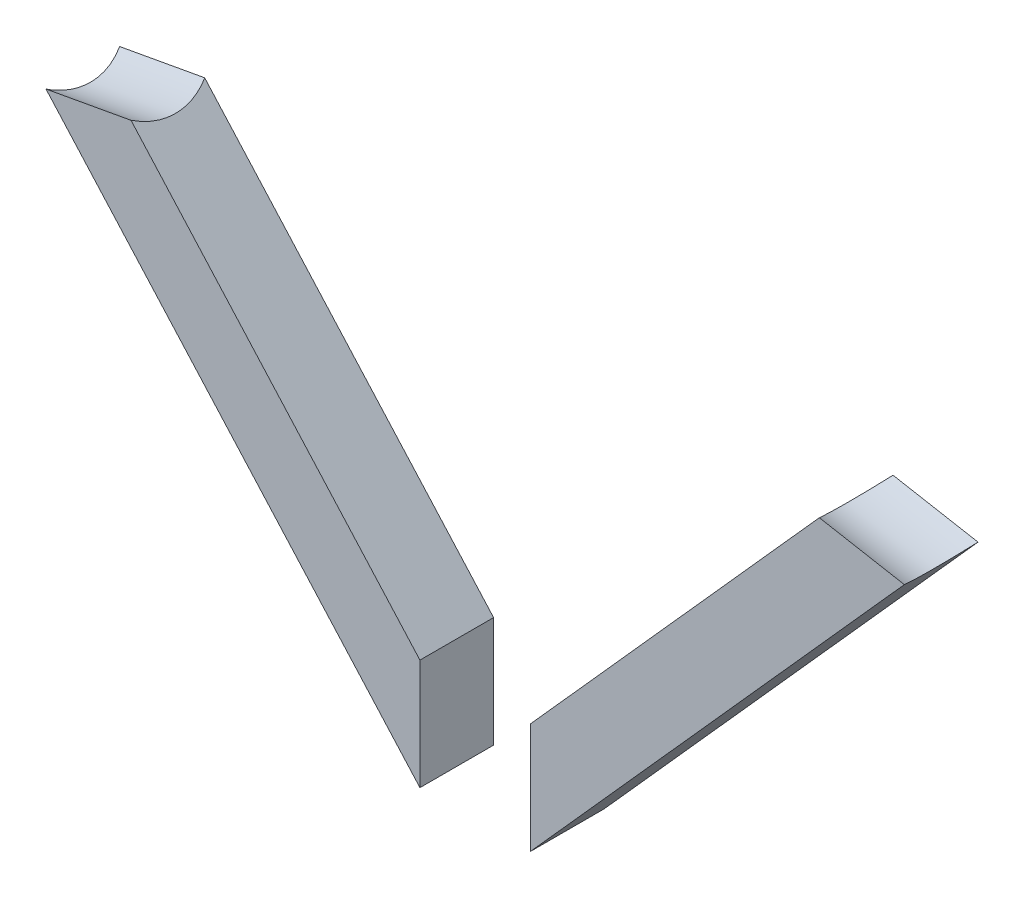
ISO-10303-21;
HEADER;
FILE_DESCRIPTION(('STEP AP214'),'2;1');
FILE_NAME('part.step','',(''),(''),'','','');
FILE_SCHEMA(('AUTOMOTIVE_DESIGN { 1 0 10303 214 1 1 1 1 }'));
ENDSEC;
DATA;
#1=APPLICATION_CONTEXT('core data for automotive mechanical design processes');
#2=APPLICATION_PROTOCOL_DEFINITION('international standard','automotive_design',2000,#1);
#3=PRODUCT_CONTEXT('',#1,'mechanical');
#4=PRODUCT('Part','Part','',(#3));
#5=PRODUCT_RELATED_PRODUCT_CATEGORY('part','',(#4));
#6=PRODUCT_DEFINITION_FORMATION('','',#4);
#7=PRODUCT_DEFINITION_CONTEXT('part definition',#1,'design');
#8=PRODUCT_DEFINITION('design','',#6,#7);
#9=PRODUCT_DEFINITION_SHAPE('','',#8);
#10=(LENGTH_UNIT() NAMED_UNIT(*) SI_UNIT(.MILLI.,.METRE.));
#11=(NAMED_UNIT(*) PLANE_ANGLE_UNIT() SI_UNIT($,.RADIAN.));
#12=(NAMED_UNIT(*) SI_UNIT($,.STERADIAN.) SOLID_ANGLE_UNIT());
#13=UNCERTAINTY_MEASURE_WITH_UNIT(LENGTH_MEASURE(1.E-05),#10,'distance_accuracy_value','');
#14=(GEOMETRIC_REPRESENTATION_CONTEXT(3) GLOBAL_UNCERTAINTY_ASSIGNED_CONTEXT((#13)) GLOBAL_UNIT_ASSIGNED_CONTEXT((#10,
#11,#12)) REPRESENTATION_CONTEXT('',''));
#15=CARTESIAN_POINT('',(0.,0.,0.));
#16=DIRECTION('',(0.,0.,1.));
#17=DIRECTION('',(1.,0.,0.));
#18=AXIS2_PLACEMENT_3D('',#15,#16,#17);
#19=CARTESIAN_POINT('',(-164.821229450956,0.,-6.35));
#20=DIRECTION('',(0.,0.,1.));
#21=DIRECTION('',(-1.,0.,0.));
#22=AXIS2_PLACEMENT_3D('',#19,#20,#21);
#23=PLANE('',#22);
#24=DIRECTION('',(-0.983892930474945,0.178758779816334,0.));
#25=VECTOR('',#24,1.);
#26=CARTESIAN_POINT('',(25.8853119541006,27.1047683952409,-6.35));
#27=LINE('',#26,#25);
#28=CARTESIAN_POINT('',(-23.0700602583597,35.999234785938,-6.35));
#29=VERTEX_POINT('',#28);
#30=CARTESIAN_POINT('',(-8.41304801678408,33.336272645543,-6.35));
#31=VERTEX_POINT('',#30);
#32=EDGE_CURVE('E12',#29,#31,#27,.F.);
#33=ORIENTED_EDGE('',*,*,#32,.T.);
#34=DIRECTION('',(-0.666666666666669,-0.745355992499928,0.));
#35=VECTOR('',#34,1.);
#36=CARTESIAN_POINT('',(-9.74359069134373,31.8486807119031,-6.35));
#37=LINE('',#36,#35);
#38=CARTESIAN_POINT('',(-72.8856147254789,-38.7462482767225,-6.35));
#39=VERTEX_POINT('',#38);
#40=EDGE_CURVE('E98',#31,#39,#37,.T.);
#41=ORIENTED_EDGE('',*,*,#40,.T.);
#42=DIRECTION('',(0.,1.,0.));
#43=VECTOR('',#42,1.);
#44=CARTESIAN_POINT('',(-72.8856147254789,-38.7462482767225,-6.35));
#45=LINE('',#44,#43);
#46=CARTESIAN_POINT('',(-72.885614725478,-19.6962482767227,-6.35));
#47=VERTEX_POINT('',#46);
#48=EDGE_CURVE('E96',#39,#47,#45,.T.);
#49=ORIENTED_EDGE('',*,*,#48,.T.);
#50=DIRECTION('',(0.666666666666662,0.745355992499934,0.));
#51=VECTOR('',#50,1.);
#52=CARTESIAN_POINT('',(-24.4006029329205,34.5116428522969,-6.35));
#53=LINE('',#52,#51);
#54=EDGE_CURVE('E109',#47,#29,#53,.T.);
#55=ORIENTED_EDGE('',*,*,#54,.T.);
#56=EDGE_LOOP('',(#33,#41,#49,#55));
#57=FACE_BOUND('',#56,.T.);
#58=ADVANCED_FACE('F44',(#57),#23,.F.);
#59=CARTESIAN_POINT('',(-164.821229450956,0.,6.35));
#60=DIRECTION('',(0.,0.,1.));
#61=DIRECTION('',(-1.,0.,0.));
#62=AXIS2_PLACEMENT_3D('',#59,#60,#61);
#63=PLANE('',#62);
#64=DIRECTION('',(0.666666666666662,0.745355992499934,0.));
#65=VECTOR('',#64,1.);
#66=CARTESIAN_POINT('',(-24.4006029329205,34.5116428522969,6.35));
#67=LINE('',#66,#65);
#68=CARTESIAN_POINT('',(-72.885614725478,-19.6962482767227,6.35));
#69=VERTEX_POINT('',#68);
#70=CARTESIAN_POINT('',(-23.0700602583597,35.999234785938,6.35));
#71=VERTEX_POINT('',#70);
#72=EDGE_CURVE('E108',#69,#71,#67,.T.);
#73=ORIENTED_EDGE('',*,*,#72,.F.);
#74=DIRECTION('',(0.,1.,0.));
#75=VECTOR('',#74,1.);
#76=CARTESIAN_POINT('',(-72.8856147254789,-38.7462482767225,6.35));
#77=LINE('',#76,#75);
#78=CARTESIAN_POINT('',(-72.8856147254789,-38.7462482767225,6.35));
#79=VERTEX_POINT('',#78);
#80=EDGE_CURVE('E93',#79,#69,#77,.T.);
#81=ORIENTED_EDGE('',*,*,#80,.F.);
#82=DIRECTION('',(-0.666666666666669,-0.745355992499928,0.));
#83=VECTOR('',#82,1.);
#84=CARTESIAN_POINT('',(-9.74359069134373,31.8486807119031,6.35));
#85=LINE('',#84,#83);
#86=CARTESIAN_POINT('',(-8.41304801678408,33.336272645543,6.35));
#87=VERTEX_POINT('',#86);
#88=EDGE_CURVE('E101',#87,#79,#85,.T.);
#89=ORIENTED_EDGE('',*,*,#88,.F.);
#90=DIRECTION('',(-0.983892930474945,0.178758779816334,0.));
#91=VECTOR('',#90,1.);
#92=CARTESIAN_POINT('',(25.8853119541006,27.1047683952409,6.35));
#93=LINE('',#92,#91);
#94=EDGE_CURVE('E105',#71,#87,#93,.F.);
#95=ORIENTED_EDGE('',*,*,#94,.F.);
#96=EDGE_LOOP('',(#73,#81,#89,#95));
#97=FACE_BOUND('',#96,.T.);
#98=ADVANCED_FACE('F107',(#97),#63,.T.);
#99=CARTESIAN_POINT('',(-24.4006029329205,34.5116428522969,-6.35));
#100=DIRECTION('',(-0.745355992499928,0.666666666666669,0.));
#101=DIRECTION('',(0.666666666666669,0.745355992499928,0.));
#102=AXIS2_PLACEMENT_3D('',#99,#100,#101);
#103=PLANE('',#102);
#104=ORIENTED_EDGE('',*,*,#54,.F.);
#105=DIRECTION('',(0.,0.,1.));
#106=VECTOR('',#105,1.);
#107=CARTESIAN_POINT('',(-72.885614725478,-19.6962482767227,-6.35));
#108=LINE('',#107,#106);
#109=EDGE_CURVE('E90',#47,#69,#108,.T.);
#110=ORIENTED_EDGE('',*,*,#109,.T.);
#111=ORIENTED_EDGE('',*,*,#72,.T.);
#112=CARTESIAN_POINT('',(-14.4692972067291,45.6151802068452,0.));
#113=DIRECTION('',(0.745355992499928,-0.666666666666669,0.));
#114=DIRECTION('',(-0.666666666666669,-0.745355992499928,0.));
#115=AXIS2_PLACEMENT_3D('',#112,#113,#114);
#116=ELLIPSE('',#115,14.8969585892852,12.7);
#117=EDGE_CURVE('E62',#29,#71,#116,.F.);
#118=ORIENTED_EDGE('',*,*,#117,.F.);
#119=EDGE_LOOP('',(#104,#110,#111,#118));
#120=FACE_BOUND('',#119,.T.);
#121=ADVANCED_FACE('F117',(#120),#103,.T.);
#122=CARTESIAN_POINT('',(-72.8856147254789,-38.7462482767225,-6.35));
#123=DIRECTION('',(-1.,0.,0.));
#124=DIRECTION('',(0.,1.,0.));
#125=AXIS2_PLACEMENT_3D('',#122,#123,#124);
#126=PLANE('',#125);
#127=ORIENTED_EDGE('',*,*,#109,.F.);
#128=ORIENTED_EDGE('',*,*,#48,.F.);
#129=DIRECTION('',(0.,0.,1.));
#130=VECTOR('',#129,1.);
#131=CARTESIAN_POINT('',(-72.8856147254789,-38.7462482767225,-6.35));
#132=LINE('',#131,#130);
#133=EDGE_CURVE('E54',#39,#79,#132,.T.);
#134=ORIENTED_EDGE('',*,*,#133,.T.);
#135=ORIENTED_EDGE('',*,*,#80,.T.);
#136=EDGE_LOOP('',(#127,#128,#134,#135));
#137=FACE_BOUND('',#136,.T.);
#138=ADVANCED_FACE('F91',(#137),#126,.T.);
#139=CARTESIAN_POINT('',(-9.74359069134373,31.8486807119031,-6.35));
#140=DIRECTION('',(0.745355992499929,-0.666666666666668,0.));
#141=DIRECTION('',(-0.666666666666668,-0.745355992499928,0.));
#142=AXIS2_PLACEMENT_3D('',#139,#140,#141);
#143=PLANE('',#142);
#144=ORIENTED_EDGE('',*,*,#88,.T.);
#145=ORIENTED_EDGE('',*,*,#133,.F.);
#146=ORIENTED_EDGE('',*,*,#40,.F.);
#147=CARTESIAN_POINT('',(0.187715034846464,42.9522180664501,0.));
#148=DIRECTION('',(-0.745355992499929,0.666666666666668,0.));
#149=DIRECTION('',(-0.666666666666668,-0.745355992499928,0.));
#150=AXIS2_PLACEMENT_3D('',#147,#148,#149);
#151=ELLIPSE('',#150,14.8969585892852,12.7);
#152=EDGE_CURVE('E48',#87,#31,#151,.F.);
#153=ORIENTED_EDGE('',*,*,#152,.F.);
#154=EDGE_LOOP('',(#144,#145,#146,#153));
#155=FACE_BOUND('',#154,.T.);
#156=ADVANCED_FACE('F102',(#155),#143,.T.);
#157=CARTESIAN_POINT('',(27.8513944388754,37.9261370546602,0.));
#158=DIRECTION('',(-0.983892930474945,0.178758779816334,0.));
#159=DIRECTION('',(0.178758779816334,0.983892930474945,0.));
#160=AXIS2_PLACEMENT_3D('',#157,#158,#159);
#161=CYLINDRICAL_SURFACE('',#160,12.7);
#162=ORIENTED_EDGE('',*,*,#32,.F.);
#163=ORIENTED_EDGE('',*,*,#117,.T.);
#164=ORIENTED_EDGE('',*,*,#94,.T.);
#165=ORIENTED_EDGE('',*,*,#152,.T.);
#166=EDGE_LOOP('',(#162,#163,#164,#165));
#167=FACE_BOUND('',#166,.T.);
#168=ADVANCED_FACE('F46',(#167),#161,.F.);
#169=CLOSED_SHELL('',(#58,#98,#121,#138,#156,#168));
#170=MANIFOLD_SOLID_BREP('B2',#169);
#171=CARTESIAN_POINT('',(0.,0.,-6.35));
#172=DIRECTION('',(0.,0.,1.));
#173=DIRECTION('',(1.,0.,0.));
#174=AXIS2_PLACEMENT_3D('',#171,#172,#173);
#175=PLANE('',#174);
#176=DIRECTION('',(0.983892930474945,0.178758779816334,0.));
#177=VECTOR('',#176,1.);
#178=CARTESIAN_POINT('',(-190.706541405057,27.1047683952409,-6.35));
#179=LINE('',#178,#177);
#180=CARTESIAN_POINT('',(-141.751169192596,35.999234785938,-6.35));
#181=VERTEX_POINT('',#180);
#182=CARTESIAN_POINT('',(-156.408181434172,33.336272645543,-6.35));
#183=VERTEX_POINT('',#182);
#184=EDGE_CURVE('E42',#181,#183,#179,.F.);
#185=ORIENTED_EDGE('',*,*,#184,.F.);
#186=DIRECTION('',(-0.666666666666662,0.745355992499934,0.));
#187=VECTOR('',#186,1.);
#188=CARTESIAN_POINT('',(-140.420626518036,34.5116428522969,-6.35));
#189=LINE('',#188,#187);
#190=CARTESIAN_POINT('',(-91.935614725478,-19.6962482767227,-6.35));
#191=VERTEX_POINT('',#190);
#192=EDGE_CURVE('E236',#191,#181,#189,.T.);
#193=ORIENTED_EDGE('',*,*,#192,.F.);
#194=DIRECTION('',(0.,1.,0.));
#195=VECTOR('',#194,1.);
#196=CARTESIAN_POINT('',(-91.9356147254772,-38.7462482767225,-6.35));
#197=LINE('',#196,#195);
#198=CARTESIAN_POINT('',(-91.9356147254772,-38.7462482767225,-6.35));
#199=VERTEX_POINT('',#198);
#200=EDGE_CURVE('E240',#199,#191,#197,.T.);
#201=ORIENTED_EDGE('',*,*,#200,.F.);
#202=DIRECTION('',(0.666666666666669,-0.745355992499928,0.));
#203=VECTOR('',#202,1.);
#204=CARTESIAN_POINT('',(-155.077638759612,31.8486807119031,-6.35));
#205=LINE('',#204,#203);
#206=EDGE_CURVE('E207',#183,#199,#205,.T.);
#207=ORIENTED_EDGE('',*,*,#206,.F.);
#208=EDGE_LOOP('',(#185,#193,#201,#207));
#209=FACE_BOUND('',#208,.T.);
#210=ADVANCED_FACE('F173',(#209),#175,.F.);
#211=CARTESIAN_POINT('',(0.,0.,6.35));
#212=DIRECTION('',(0.,0.,1.));
#213=DIRECTION('',(1.,0.,0.));
#214=AXIS2_PLACEMENT_3D('',#211,#212,#213);
#215=PLANE('',#214);
#216=DIRECTION('',(-0.666666666666662,0.745355992499934,0.));
#217=VECTOR('',#216,1.);
#218=CARTESIAN_POINT('',(-140.420626518036,34.5116428522969,6.35));
#219=LINE('',#218,#217);
#220=CARTESIAN_POINT('',(-91.935614725478,-19.6962482767227,6.35));
#221=VERTEX_POINT('',#220);
#222=CARTESIAN_POINT('',(-141.751169192596,35.999234785938,6.35));
#223=VERTEX_POINT('',#222);
#224=EDGE_CURVE('E244',#221,#223,#219,.T.);
#225=ORIENTED_EDGE('',*,*,#224,.T.);
#226=DIRECTION('',(0.983892930474945,0.178758779816334,0.));
#227=VECTOR('',#226,1.);
#228=CARTESIAN_POINT('',(-190.706541405057,27.1047683952409,6.35));
#229=LINE('',#228,#227);
#230=CARTESIAN_POINT('',(-156.408181434172,33.336272645543,6.35));
#231=VERTEX_POINT('',#230);
#232=EDGE_CURVE('E228',#223,#231,#229,.F.);
#233=ORIENTED_EDGE('',*,*,#232,.T.);
#234=DIRECTION('',(0.666666666666669,-0.745355992499928,0.));
#235=VECTOR('',#234,1.);
#236=CARTESIAN_POINT('',(-155.077638759612,31.8486807119031,6.35));
#237=LINE('',#236,#235);
#238=CARTESIAN_POINT('',(-91.9356147254772,-38.7462482767225,6.35));
#239=VERTEX_POINT('',#238);
#240=EDGE_CURVE('E223',#231,#239,#237,.T.);
#241=ORIENTED_EDGE('',*,*,#240,.T.);
#242=DIRECTION('',(0.,1.,0.));
#243=VECTOR('',#242,1.);
#244=CARTESIAN_POINT('',(-91.9356147254772,-38.7462482767225,6.35));
#245=LINE('',#244,#243);
#246=EDGE_CURVE('E227',#239,#221,#245,.T.);
#247=ORIENTED_EDGE('',*,*,#246,.T.);
#248=EDGE_LOOP('',(#225,#233,#241,#247));
#249=FACE_BOUND('',#248,.T.);
#250=ADVANCED_FACE('F225',(#249),#215,.T.);
#251=CARTESIAN_POINT('',(-140.420626518036,34.5116428522969,-6.35));
#252=DIRECTION('',(0.745355992499928,0.666666666666669,0.));
#253=DIRECTION('',(-0.666666666666669,0.745355992499928,0.));
#254=AXIS2_PLACEMENT_3D('',#251,#252,#253);
#255=PLANE('',#254);
#256=ORIENTED_EDGE('',*,*,#192,.T.);
#257=CARTESIAN_POINT('',(-150.351932244227,45.6151802068452,0.));
#258=DIRECTION('',(0.745355992499928,0.666666666666669,0.));
#259=DIRECTION('',(0.666666666666669,-0.745355992499928,0.));
#260=AXIS2_PLACEMENT_3D('',#257,#258,#259);
#261=ELLIPSE('',#260,14.8969585892852,12.7);
#262=EDGE_CURVE('E190',#181,#223,#261,.F.);
#263=ORIENTED_EDGE('',*,*,#262,.T.);
#264=ORIENTED_EDGE('',*,*,#224,.F.);
#265=DIRECTION('',(0.,0.,1.));
#266=VECTOR('',#265,1.);
#267=CARTESIAN_POINT('',(-91.935614725478,-19.6962482767227,-6.35));
#268=LINE('',#267,#266);
#269=EDGE_CURVE('E216',#191,#221,#268,.T.);
#270=ORIENTED_EDGE('',*,*,#269,.F.);
#271=EDGE_LOOP('',(#256,#263,#264,#270));
#272=FACE_BOUND('',#271,.T.);
#273=ADVANCED_FACE('F247',(#272),#255,.T.);
#274=CARTESIAN_POINT('',(-91.9356147254772,-38.7462482767225,-6.35));
#275=DIRECTION('',(1.,0.,0.));
#276=DIRECTION('',(0.,1.,0.));
#277=AXIS2_PLACEMENT_3D('',#274,#275,#276);
#278=PLANE('',#277);
#279=ORIENTED_EDGE('',*,*,#269,.T.);
#280=ORIENTED_EDGE('',*,*,#246,.F.);
#281=DIRECTION('',(0.,0.,1.));
#282=VECTOR('',#281,1.);
#283=CARTESIAN_POINT('',(-91.9356147254772,-38.7462482767225,-6.35));
#284=LINE('',#283,#282);
#285=EDGE_CURVE('E183',#199,#239,#284,.T.);
#286=ORIENTED_EDGE('',*,*,#285,.F.);
#287=ORIENTED_EDGE('',*,*,#200,.T.);
#288=EDGE_LOOP('',(#279,#280,#286,#287));
#289=FACE_BOUND('',#288,.T.);
#290=ADVANCED_FACE('F235',(#289),#278,.T.);
#291=CARTESIAN_POINT('',(-155.077638759612,31.8486807119031,-6.35));
#292=DIRECTION('',(-0.745355992499929,-0.666666666666668,0.));
#293=DIRECTION('',(0.666666666666668,-0.745355992499928,0.));
#294=AXIS2_PLACEMENT_3D('',#291,#292,#293);
#295=PLANE('',#294);
#296=ORIENTED_EDGE('',*,*,#240,.F.);
#297=CARTESIAN_POINT('',(-165.008944485803,42.9522180664501,0.));
#298=DIRECTION('',(-0.745355992499929,-0.666666666666668,0.));
#299=DIRECTION('',(0.666666666666668,-0.745355992499928,0.));
#300=AXIS2_PLACEMENT_3D('',#297,#298,#299);
#301=ELLIPSE('',#300,14.8969585892852,12.7);
#302=EDGE_CURVE('E177',#231,#183,#301,.F.);
#303=ORIENTED_EDGE('',*,*,#302,.T.);
#304=ORIENTED_EDGE('',*,*,#206,.T.);
#305=ORIENTED_EDGE('',*,*,#285,.T.);
#306=EDGE_LOOP('',(#296,#303,#304,#305));
#307=FACE_BOUND('',#306,.T.);
#308=ADVANCED_FACE('F230',(#307),#295,.T.);
#309=CARTESIAN_POINT('',(-192.672623889831,37.9261370546602,0.));
#310=DIRECTION('',(0.983892930474945,0.178758779816334,0.));
#311=DIRECTION('',(-0.178758779816334,0.983892930474945,0.));
#312=AXIS2_PLACEMENT_3D('',#309,#310,#311);
#313=CYLINDRICAL_SURFACE('',#312,12.7);
#314=ORIENTED_EDGE('',*,*,#184,.T.);
#315=ORIENTED_EDGE('',*,*,#302,.F.);
#316=ORIENTED_EDGE('',*,*,#232,.F.);
#317=ORIENTED_EDGE('',*,*,#262,.F.);
#318=EDGE_LOOP('',(#314,#315,#316,#317));
#319=FACE_BOUND('',#318,.T.);
#320=ADVANCED_FACE('F175',(#319),#313,.F.);
#321=CLOSED_SHELL('',(#210,#250,#273,#290,#308,#320));
#322=MANIFOLD_SOLID_BREP('B6',#321);
#323=ADVANCED_BREP_SHAPE_REPRESENTATION('',(#18,#170,#322),#14);
#324=SHAPE_DEFINITION_REPRESENTATION(#9,#323);
ENDSEC;
END-ISO-10303-21;
